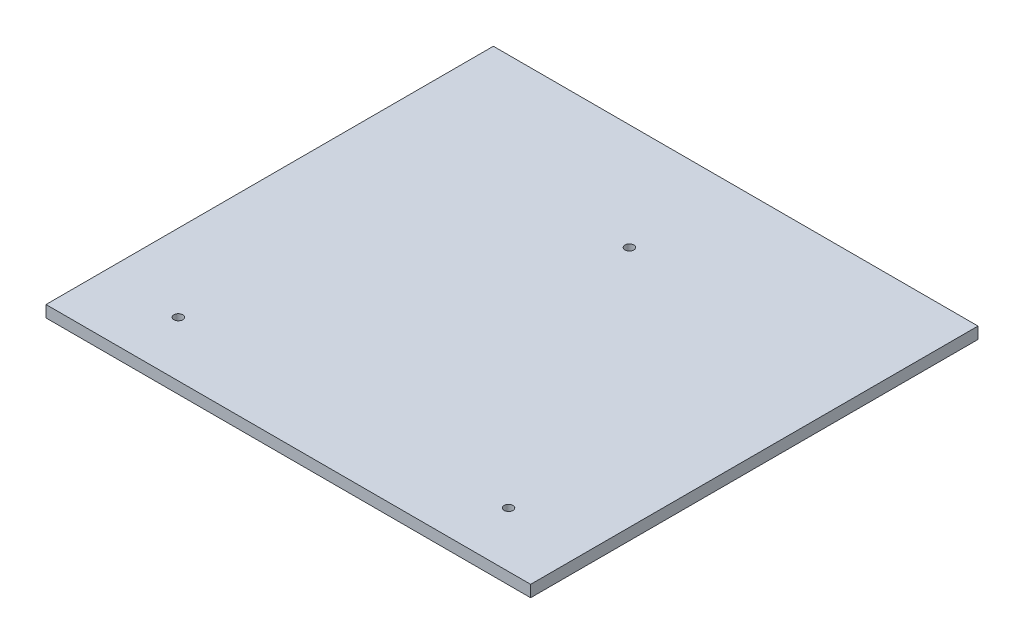
ISO-10303-21;
HEADER;
FILE_DESCRIPTION(('STEP AP214'),'2;1');
FILE_NAME('part.step','',(''),(''),'','','');
FILE_SCHEMA(('AUTOMOTIVE_DESIGN { 1 0 10303 214 1 1 1 1 }'));
ENDSEC;
DATA;
#1=APPLICATION_CONTEXT('core data for automotive mechanical design processes');
#2=APPLICATION_PROTOCOL_DEFINITION('international standard','automotive_design',2000,#1);
#3=PRODUCT_CONTEXT('',#1,'mechanical');
#4=PRODUCT('Part','Part','',(#3));
#5=PRODUCT_RELATED_PRODUCT_CATEGORY('part','',(#4));
#6=PRODUCT_DEFINITION_FORMATION('','',#4);
#7=PRODUCT_DEFINITION_CONTEXT('part definition',#1,'design');
#8=PRODUCT_DEFINITION('design','',#6,#7);
#9=PRODUCT_DEFINITION_SHAPE('','',#8);
#10=(LENGTH_UNIT() NAMED_UNIT(*) SI_UNIT(.MILLI.,.METRE.));
#11=(NAMED_UNIT(*) PLANE_ANGLE_UNIT() SI_UNIT($,.RADIAN.));
#12=(NAMED_UNIT(*) SI_UNIT($,.STERADIAN.) SOLID_ANGLE_UNIT());
#13=UNCERTAINTY_MEASURE_WITH_UNIT(LENGTH_MEASURE(1.E-05),#10,'distance_accuracy_value','');
#14=(GEOMETRIC_REPRESENTATION_CONTEXT(3) GLOBAL_UNCERTAINTY_ASSIGNED_CONTEXT((#13)) GLOBAL_UNIT_ASSIGNED_CONTEXT((#10,
#11,#12)) REPRESENTATION_CONTEXT('',''));
#15=CARTESIAN_POINT('',(0.,0.,0.));
#16=DIRECTION('',(0.,0.,1.));
#17=DIRECTION('',(1.,0.,0.));
#18=AXIS2_PLACEMENT_3D('',#15,#16,#17);
#19=CARTESIAN_POINT('',(0.,15.875,0.));
#20=DIRECTION('',(1.,0.,0.));
#21=DIRECTION('',(0.,0.,-1.));
#22=AXIS2_PLACEMENT_3D('',#19,#20,#21);
#23=PLANE('',#22);
#24=DIRECTION('',(0.,0.,1.));
#25=VECTOR('',#24,1.);
#26=CARTESIAN_POINT('',(0.,0.,0.));
#27=LINE('',#26,#25);
#28=CARTESIAN_POINT('',(0.,0.,-609.6));
#29=VERTEX_POINT('',#28);
#30=CARTESIAN_POINT('',(0.,0.,0.));
#31=VERTEX_POINT('',#30);
#32=EDGE_CURVE('E107',#29,#31,#27,.T.);
#33=ORIENTED_EDGE('',*,*,#32,.T.);
#34=DIRECTION('',(0.,-1.,0.));
#35=VECTOR('',#34,1.);
#36=CARTESIAN_POINT('',(0.,15.875,0.));
#37=LINE('',#36,#35);
#38=CARTESIAN_POINT('',(0.,15.875,0.));
#39=VERTEX_POINT('',#38);
#40=EDGE_CURVE('E11',#39,#31,#37,.T.);
#41=ORIENTED_EDGE('',*,*,#40,.F.);
#42=DIRECTION('',(0.,0.,1.));
#43=VECTOR('',#42,1.);
#44=CARTESIAN_POINT('',(0.,15.875,0.));
#45=LINE('',#44,#43);
#46=CARTESIAN_POINT('',(0.,15.875,-609.6));
#47=VERTEX_POINT('',#46);
#48=EDGE_CURVE('E91',#47,#39,#45,.T.);
#49=ORIENTED_EDGE('',*,*,#48,.F.);
#50=DIRECTION('',(0.,-1.,0.));
#51=VECTOR('',#50,1.);
#52=CARTESIAN_POINT('',(0.,15.875,-609.6));
#53=LINE('',#52,#51);
#54=EDGE_CURVE('E103',#47,#29,#53,.T.);
#55=ORIENTED_EDGE('',*,*,#54,.T.);
#56=EDGE_LOOP('',(#33,#41,#49,#55));
#57=FACE_BOUND('',#56,.T.);
#58=ADVANCED_FACE('F39',(#57),#23,.F.);
#59=CARTESIAN_POINT('',(0.,15.875,0.));
#60=DIRECTION('',(0.,0.,-1.));
#61=DIRECTION('',(-1.,0.,0.));
#62=AXIS2_PLACEMENT_3D('',#59,#60,#61);
#63=PLANE('',#62);
#64=DIRECTION('',(1.,0.,0.));
#65=VECTOR('',#64,1.);
#66=CARTESIAN_POINT('',(0.,0.,0.));
#67=LINE('',#66,#65);
#68=CARTESIAN_POINT('',(660.4,0.,0.));
#69=VERTEX_POINT('',#68);
#70=EDGE_CURVE('E96',#31,#69,#67,.T.);
#71=ORIENTED_EDGE('',*,*,#70,.T.);
#72=DIRECTION('',(0.,-1.,0.));
#73=VECTOR('',#72,1.);
#74=CARTESIAN_POINT('',(660.4,15.875,0.));
#75=LINE('',#74,#73);
#76=CARTESIAN_POINT('',(660.4,15.875,0.));
#77=VERTEX_POINT('',#76);
#78=EDGE_CURVE('E48',#77,#69,#75,.T.);
#79=ORIENTED_EDGE('',*,*,#78,.F.);
#80=DIRECTION('',(1.,0.,0.));
#81=VECTOR('',#80,1.);
#82=CARTESIAN_POINT('',(0.,15.875,0.));
#83=LINE('',#82,#81);
#84=EDGE_CURVE('E86',#39,#77,#83,.T.);
#85=ORIENTED_EDGE('',*,*,#84,.F.);
#86=ORIENTED_EDGE('',*,*,#40,.T.);
#87=EDGE_LOOP('',(#71,#79,#85,#86));
#88=FACE_BOUND('',#87,.T.);
#89=ADVANCED_FACE('F95',(#88),#63,.F.);
#90=CARTESIAN_POINT('',(660.4,15.875,0.));
#91=DIRECTION('',(-1.,0.,0.));
#92=DIRECTION('',(0.,0.,1.));
#93=AXIS2_PLACEMENT_3D('',#90,#91,#92);
#94=PLANE('',#93);
#95=DIRECTION('',(0.,0.,-1.));
#96=VECTOR('',#95,1.);
#97=CARTESIAN_POINT('',(660.4,0.,0.));
#98=LINE('',#97,#96);
#99=CARTESIAN_POINT('',(660.4,0.,-609.6));
#100=VERTEX_POINT('',#99);
#101=EDGE_CURVE('E73',#69,#100,#98,.T.);
#102=ORIENTED_EDGE('',*,*,#101,.T.);
#103=DIRECTION('',(0.,-1.,0.));
#104=VECTOR('',#103,1.);
#105=CARTESIAN_POINT('',(660.4,15.875,-609.6));
#106=LINE('',#105,#104);
#107=CARTESIAN_POINT('',(660.4,15.875,-609.6));
#108=VERTEX_POINT('',#107);
#109=EDGE_CURVE('E98',#108,#100,#106,.T.);
#110=ORIENTED_EDGE('',*,*,#109,.F.);
#111=DIRECTION('',(0.,0.,-1.));
#112=VECTOR('',#111,1.);
#113=CARTESIAN_POINT('',(660.4,15.875,0.));
#114=LINE('',#113,#112);
#115=EDGE_CURVE('E89',#77,#108,#114,.T.);
#116=ORIENTED_EDGE('',*,*,#115,.F.);
#117=ORIENTED_EDGE('',*,*,#78,.T.);
#118=EDGE_LOOP('',(#102,#110,#116,#117));
#119=FACE_BOUND('',#118,.T.);
#120=ADVANCED_FACE('F99',(#119),#94,.F.);
#121=CARTESIAN_POINT('',(0.,15.875,-609.6));
#122=DIRECTION('',(0.,0.,1.));
#123=DIRECTION('',(1.,0.,0.));
#124=AXIS2_PLACEMENT_3D('',#121,#122,#123);
#125=PLANE('',#124);
#126=DIRECTION('',(-1.,0.,0.));
#127=VECTOR('',#126,1.);
#128=CARTESIAN_POINT('',(0.,0.,-609.6));
#129=LINE('',#128,#127);
#130=EDGE_CURVE('E79',#100,#29,#129,.T.);
#131=ORIENTED_EDGE('',*,*,#130,.T.);
#132=ORIENTED_EDGE('',*,*,#54,.F.);
#133=DIRECTION('',(-1.,0.,0.));
#134=VECTOR('',#133,1.);
#135=CARTESIAN_POINT('',(0.,15.875,-609.6));
#136=LINE('',#135,#134);
#137=EDGE_CURVE('E56',#108,#47,#136,.T.);
#138=ORIENTED_EDGE('',*,*,#137,.F.);
#139=ORIENTED_EDGE('',*,*,#109,.T.);
#140=EDGE_LOOP('',(#131,#132,#138,#139));
#141=FACE_BOUND('',#140,.T.);
#142=ADVANCED_FACE('F121',(#141),#125,.F.);
#143=CARTESIAN_POINT('',(0.,15.875,0.));
#144=DIRECTION('',(0.,-1.,0.));
#145=DIRECTION('',(0.,0.,-1.));
#146=AXIS2_PLACEMENT_3D('',#143,#144,#145);
#147=PLANE('',#146);
#148=CARTESIAN_POINT('',(105.2,15.875,-75.1166466365201));
#149=DIRECTION('',(0.,1.,0.));
#150=DIRECTION('',(0.,0.,1.));
#151=AXIS2_PLACEMENT_3D('',#148,#149,#150);
#152=CIRCLE('',#151,5.9944);
#153=CARTESIAN_POINT('',(105.2,15.875,-69.1222466365201));
#154=VERTEX_POINT('',#153);
#155=EDGE_CURVE('E144',#154,#154,#152,.T.);
#156=ORIENTED_EDGE('',*,*,#155,.F.);
#157=EDGE_LOOP('',(#156));
#158=FACE_BOUND('',#157,.T.);
#159=CARTESIAN_POINT('',(555.2,15.875,-75.1166466365201));
#160=DIRECTION('',(0.,1.,0.));
#161=DIRECTION('',(0.,0.,1.));
#162=AXIS2_PLACEMENT_3D('',#159,#160,#161);
#163=CIRCLE('',#162,5.99440000000001);
#164=CARTESIAN_POINT('',(555.2,15.875,-69.1222466365201));
#165=VERTEX_POINT('',#164);
#166=EDGE_CURVE('E136',#165,#165,#163,.T.);
#167=ORIENTED_EDGE('',*,*,#166,.F.);
#168=EDGE_LOOP('',(#167));
#169=FACE_BOUND('',#168,.T.);
#170=CARTESIAN_POINT('',(330.2,15.875,-464.828078339517));
#171=DIRECTION('',(0.,1.,0.));
#172=DIRECTION('',(0.,0.,1.));
#173=AXIS2_PLACEMENT_3D('',#170,#171,#172);
#174=CIRCLE('',#173,5.99440000000001);
#175=CARTESIAN_POINT('',(330.2,15.875,-458.833678339517));
#176=VERTEX_POINT('',#175);
#177=EDGE_CURVE('E128',#176,#176,#174,.T.);
#178=ORIENTED_EDGE('',*,*,#177,.F.);
#179=EDGE_LOOP('',(#178));
#180=FACE_BOUND('',#179,.T.);
#181=ORIENTED_EDGE('',*,*,#48,.T.);
#182=ORIENTED_EDGE('',*,*,#84,.T.);
#183=ORIENTED_EDGE('',*,*,#115,.T.);
#184=ORIENTED_EDGE('',*,*,#137,.T.);
#185=EDGE_LOOP('',(#181,#182,#183,#184));
#186=FACE_BOUND('',#185,.T.);
#187=ADVANCED_FACE('F87',(#158,#169,#180,#186),#147,.F.);
#188=CARTESIAN_POINT('',(0.,0.,0.));
#189=DIRECTION('',(0.,-1.,0.));
#190=DIRECTION('',(0.,0.,-1.));
#191=AXIS2_PLACEMENT_3D('',#188,#189,#190);
#192=PLANE('',#191);
#193=CARTESIAN_POINT('',(105.2,0.,-75.1166466365201));
#194=DIRECTION('',(0.,1.,0.));
#195=DIRECTION('',(0.,0.,1.));
#196=AXIS2_PLACEMENT_3D('',#193,#194,#195);
#197=CIRCLE('',#196,5.9944);
#198=CARTESIAN_POINT('',(105.2,0.,-69.1222466365201));
#199=VERTEX_POINT('',#198);
#200=EDGE_CURVE('E111',#199,#199,#197,.T.);
#201=ORIENTED_EDGE('',*,*,#200,.T.);
#202=EDGE_LOOP('',(#201));
#203=FACE_BOUND('',#202,.T.);
#204=CARTESIAN_POINT('',(555.2,0.,-75.1166466365201));
#205=DIRECTION('',(0.,1.,0.));
#206=DIRECTION('',(0.,0.,1.));
#207=AXIS2_PLACEMENT_3D('',#204,#205,#206);
#208=CIRCLE('',#207,5.99440000000001);
#209=CARTESIAN_POINT('',(555.2,0.,-69.1222466365201));
#210=VERTEX_POINT('',#209);
#211=EDGE_CURVE('E140',#210,#210,#208,.T.);
#212=ORIENTED_EDGE('',*,*,#211,.T.);
#213=EDGE_LOOP('',(#212));
#214=FACE_BOUND('',#213,.T.);
#215=CARTESIAN_POINT('',(330.2,0.,-464.828078339517));
#216=DIRECTION('',(0.,1.,0.));
#217=DIRECTION('',(0.,0.,1.));
#218=AXIS2_PLACEMENT_3D('',#215,#216,#217);
#219=CIRCLE('',#218,5.99440000000001);
#220=CARTESIAN_POINT('',(330.2,0.,-458.833678339517));
#221=VERTEX_POINT('',#220);
#222=EDGE_CURVE('E132',#221,#221,#219,.T.);
#223=ORIENTED_EDGE('',*,*,#222,.T.);
#224=EDGE_LOOP('',(#223));
#225=FACE_BOUND('',#224,.T.);
#226=ORIENTED_EDGE('',*,*,#32,.F.);
#227=ORIENTED_EDGE('',*,*,#130,.F.);
#228=ORIENTED_EDGE('',*,*,#101,.F.);
#229=ORIENTED_EDGE('',*,*,#70,.F.);
#230=EDGE_LOOP('',(#226,#227,#228,#229));
#231=FACE_BOUND('',#230,.T.);
#232=ADVANCED_FACE('F124',(#203,#214,#225,#231),#192,.T.);
#233=CARTESIAN_POINT('',(330.2,0.,-464.828078339517));
#234=DIRECTION('',(0.,1.,0.));
#235=DIRECTION('',(0.,0.,1.));
#236=AXIS2_PLACEMENT_3D('',#233,#234,#235);
#237=CYLINDRICAL_SURFACE('',#236,5.99440000000001);
#238=ORIENTED_EDGE('',*,*,#222,.F.);
#239=EDGE_LOOP('',(#238));
#240=FACE_BOUND('',#239,.T.);
#241=ORIENTED_EDGE('',*,*,#177,.T.);
#242=EDGE_LOOP('',(#241));
#243=FACE_BOUND('',#242,.T.);
#244=ADVANCED_FACE('F168',(#240,#243),#237,.F.);
#245=CARTESIAN_POINT('',(555.2,0.,-75.1166466365201));
#246=DIRECTION('',(0.,1.,0.));
#247=DIRECTION('',(0.,0.,1.));
#248=AXIS2_PLACEMENT_3D('',#245,#246,#247);
#249=CYLINDRICAL_SURFACE('',#248,5.99440000000001);
#250=ORIENTED_EDGE('',*,*,#211,.F.);
#251=EDGE_LOOP('',(#250));
#252=FACE_BOUND('',#251,.T.);
#253=ORIENTED_EDGE('',*,*,#166,.T.);
#254=EDGE_LOOP('',(#253));
#255=FACE_BOUND('',#254,.T.);
#256=ADVANCED_FACE('F157',(#252,#255),#249,.F.);
#257=CARTESIAN_POINT('',(105.2,0.,-75.1166466365201));
#258=DIRECTION('',(0.,1.,0.));
#259=DIRECTION('',(0.,0.,1.));
#260=AXIS2_PLACEMENT_3D('',#257,#258,#259);
#261=CYLINDRICAL_SURFACE('',#260,5.9944);
#262=ORIENTED_EDGE('',*,*,#200,.F.);
#263=EDGE_LOOP('',(#262));
#264=FACE_BOUND('',#263,.T.);
#265=ORIENTED_EDGE('',*,*,#155,.T.);
#266=EDGE_LOOP('',(#265));
#267=FACE_BOUND('',#266,.T.);
#268=ADVANCED_FACE('F154',(#264,#267),#261,.F.);
#269=CLOSED_SHELL('',(#58,#89,#120,#142,#187,#232,#244,#256,#268));
#270=MANIFOLD_SOLID_BREP('B2',#269);
#271=ADVANCED_BREP_SHAPE_REPRESENTATION('',(#18,#270),#14);
#272=SHAPE_DEFINITION_REPRESENTATION(#9,#271);
ENDSEC;
END-ISO-10303-21;
